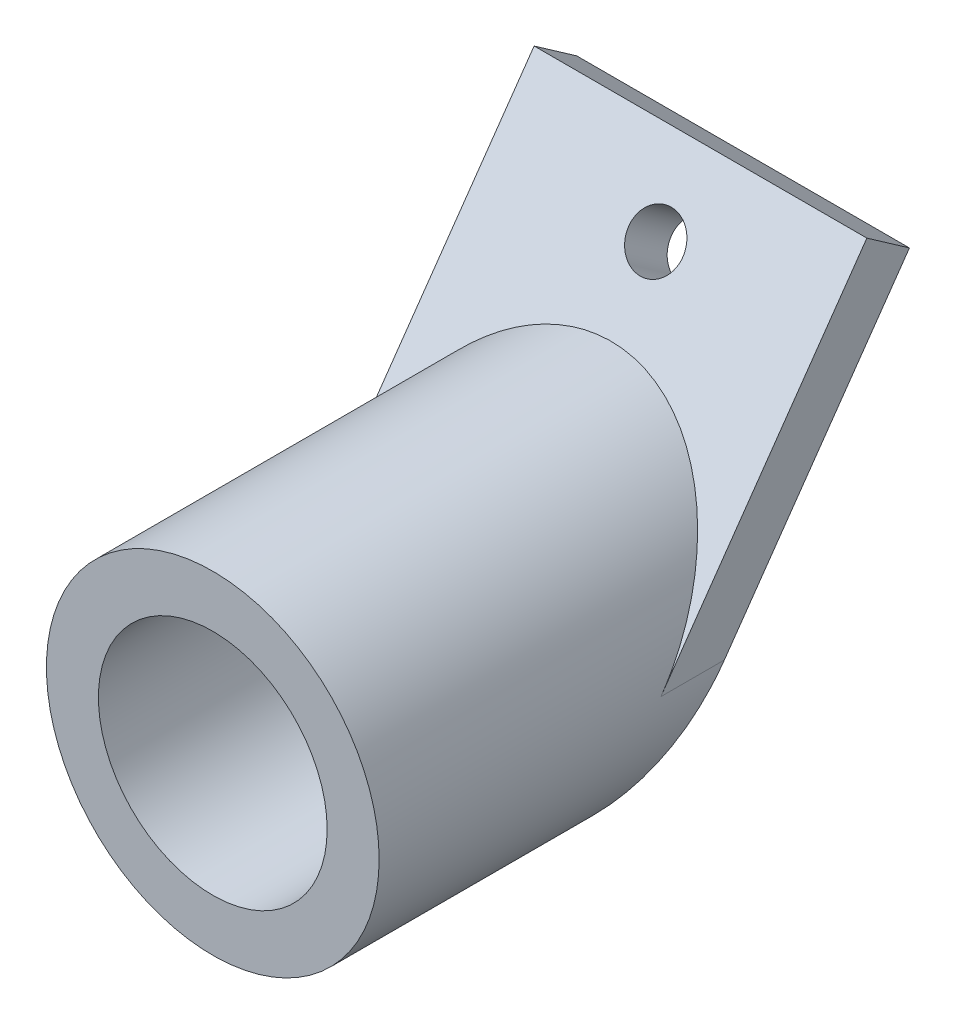
ISO-10303-21;
HEADER;
FILE_DESCRIPTION(('STEP AP214'),'2;1');
FILE_NAME('part.step','',(''),(''),'','','');
FILE_SCHEMA(('AUTOMOTIVE_DESIGN { 1 0 10303 214 1 1 1 1 }'));
ENDSEC;
DATA;
#1=APPLICATION_CONTEXT('core data for automotive mechanical design processes');
#2=APPLICATION_PROTOCOL_DEFINITION('international standard','automotive_design',2000,#1);
#3=PRODUCT_CONTEXT('',#1,'mechanical');
#4=PRODUCT('Part','Part','',(#3));
#5=PRODUCT_RELATED_PRODUCT_CATEGORY('part','',(#4));
#6=PRODUCT_DEFINITION_FORMATION('','',#4);
#7=PRODUCT_DEFINITION_CONTEXT('part definition',#1,'design');
#8=PRODUCT_DEFINITION('design','',#6,#7);
#9=PRODUCT_DEFINITION_SHAPE('','',#8);
#10=(LENGTH_UNIT() NAMED_UNIT(*) SI_UNIT(.MILLI.,.METRE.));
#11=(NAMED_UNIT(*) PLANE_ANGLE_UNIT() SI_UNIT($,.RADIAN.));
#12=(NAMED_UNIT(*) SI_UNIT($,.STERADIAN.) SOLID_ANGLE_UNIT());
#13=UNCERTAINTY_MEASURE_WITH_UNIT(LENGTH_MEASURE(1.E-05),#10,'distance_accuracy_value','');
#14=(GEOMETRIC_REPRESENTATION_CONTEXT(3) GLOBAL_UNCERTAINTY_ASSIGNED_CONTEXT((#13)) GLOBAL_UNIT_ASSIGNED_CONTEXT((#10,
#11,#12)) REPRESENTATION_CONTEXT('',''));
#15=CARTESIAN_POINT('',(0.,0.,0.));
#16=DIRECTION('',(0.,0.,1.));
#17=DIRECTION('',(1.,0.,0.));
#18=AXIS2_PLACEMENT_3D('',#15,#16,#17);
#19=CARTESIAN_POINT('',(16.,16.,-18.3027682789034));
#20=DIRECTION('',(0.,-0.573576436351044,-0.819152044288993));
#21=DIRECTION('',(0.,0.819152044288993,-0.573576436351044));
#22=AXIS2_PLACEMENT_3D('',#19,#20,#21);
#23=PLANE('',#22);
#24=CARTESIAN_POINT('',(0.,22.1436403321675,-22.6045915515363));
#25=DIRECTION('',(0.,0.573576436351044,0.819152044288993));
#26=DIRECTION('',(0.,-0.819152044288993,0.573576436351044));
#27=AXIS2_PLACEMENT_3D('',#24,#25,#26);
#28=CIRCLE('',#27,2.6);
#29=CARTESIAN_POINT('',(0.,20.0138450170161,-21.1132928170235));
#30=VERTEX_POINT('',#29);
#31=EDGE_CURVE('E230',#30,#30,#28,.T.);
#32=ORIENTED_EDGE('',*,*,#31,.F.);
#33=EDGE_LOOP('',(#32));
#34=FACE_BOUND('',#33,.T.);
#35=CARTESIAN_POINT('',(0.,0.,-7.09944766754814));
#36=DIRECTION('',(0.,-0.573576436351044,-0.819152044288993));
#37=DIRECTION('',(0.,-0.819152044288993,0.573576436351044));
#38=AXIS2_PLACEMENT_3D('',#35,#36,#37);
#39=ELLIPSE('',#38,19.5323934201833,16.);
#40=CARTESIAN_POINT('',(16.,0.,-7.09944766754815));
#41=VERTEX_POINT('',#40);
#42=CARTESIAN_POINT('',(-16.,0.,-7.09944766754815));
#43=VERTEX_POINT('',#42);
#44=EDGE_CURVE('E81',#41,#43,#39,.F.);
#45=ORIENTED_EDGE('',*,*,#44,.F.);
#46=DIRECTION('',(0.,-0.819152044288994,0.573576436351043));
#47=VECTOR('',#46,1.);
#48=CARTESIAN_POINT('',(16.,16.,-18.3027682789034));
#49=LINE('',#48,#47);
#50=CARTESIAN_POINT('',(16.,28.2872806643349,-26.9064148241691));
#51=VERTEX_POINT('',#50);
#52=EDGE_CURVE('E103',#51,#41,#49,.T.);
#53=ORIENTED_EDGE('',*,*,#52,.F.);
#54=DIRECTION('',(-1.,0.,0.));
#55=VECTOR('',#54,1.);
#56=CARTESIAN_POINT('',(16.,28.2872806643349,-26.9064148241691));
#57=LINE('',#56,#55);
#58=CARTESIAN_POINT('',(-16.,28.2872806643349,-26.9064148241691));
#59=VERTEX_POINT('',#58);
#60=EDGE_CURVE('E105',#51,#59,#57,.T.);
#61=ORIENTED_EDGE('',*,*,#60,.T.);
#62=DIRECTION('',(0.,-0.819152044288994,0.573576436351043));
#63=VECTOR('',#62,1.);
#64=CARTESIAN_POINT('',(-16.,16.,-18.3027682789034));
#65=LINE('',#64,#63);
#66=EDGE_CURVE('E96',#59,#43,#65,.T.);
#67=ORIENTED_EDGE('',*,*,#66,.T.);
#68=EDGE_LOOP('',(#45,#53,#61,#67));
#69=FACE_BOUND('',#68,.T.);
#70=ADVANCED_FACE('F35',(#34,#69),#23,.F.);
#71=CARTESIAN_POINT('',(0.,0.,20.));
#72=DIRECTION('',(0.,0.,1.));
#73=DIRECTION('',(1.,0.,0.));
#74=AXIS2_PLACEMENT_3D('',#71,#72,#73);
#75=PLANE('',#74);
#76=CARTESIAN_POINT('',(0.,0.,20.));
#77=DIRECTION('',(0.,0.,1.));
#78=DIRECTION('',(1.,0.,0.));
#79=AXIS2_PLACEMENT_3D('',#76,#77,#78);
#80=CIRCLE('',#79,16.);
#81=CARTESIAN_POINT('',(16.,0.,20.));
#82=VERTEX_POINT('',#81);
#83=EDGE_CURVE('E44',#82,#82,#80,.T.);
#84=ORIENTED_EDGE('',*,*,#83,.T.);
#85=EDGE_LOOP('',(#84));
#86=FACE_BOUND('',#85,.T.);
#87=CARTESIAN_POINT('',(0.,0.,20.));
#88=DIRECTION('',(0.,0.,1.));
#89=DIRECTION('',(1.,0.,0.));
#90=AXIS2_PLACEMENT_3D('',#87,#88,#89);
#91=CIRCLE('',#90,11.);
#92=CARTESIAN_POINT('',(11.,0.,20.));
#93=VERTEX_POINT('',#92);
#94=EDGE_CURVE('E110',#93,#93,#91,.T.);
#95=ORIENTED_EDGE('',*,*,#94,.F.);
#96=EDGE_LOOP('',(#95));
#97=FACE_BOUND('',#96,.T.);
#98=ADVANCED_FACE('F118',(#86,#97),#75,.T.);
#99=CARTESIAN_POINT('',(0.,0.,20.));
#100=DIRECTION('',(0.,0.,-1.));
#101=DIRECTION('',(-1.,0.,0.));
#102=AXIS2_PLACEMENT_3D('',#99,#100,#101);
#103=CYLINDRICAL_SURFACE('',#102,16.);
#104=DIRECTION('',(0.,0.,1.));
#105=VECTOR('',#104,1.);
#106=CARTESIAN_POINT('',(16.,0.,-31.002175045614));
#107=LINE('',#106,#105);
#108=CARTESIAN_POINT('',(16.,0.,-13.2033206113553));
#109=VERTEX_POINT('',#108);
#110=EDGE_CURVE('E89',#109,#41,#107,.T.);
#111=ORIENTED_EDGE('',*,*,#110,.T.);
#112=ORIENTED_EDGE('',*,*,#44,.T.);
#113=DIRECTION('',(0.,0.,-1.));
#114=VECTOR('',#113,1.);
#115=CARTESIAN_POINT('',(-16.,0.,0.));
#116=LINE('',#115,#114);
#117=CARTESIAN_POINT('',(-16.,0.,-13.2033206113553));
#118=VERTEX_POINT('',#117);
#119=EDGE_CURVE('E11',#43,#118,#116,.T.);
#120=ORIENTED_EDGE('',*,*,#119,.T.);
#121=CARTESIAN_POINT('',(0.,0.,-13.2033206113553));
#122=DIRECTION('',(0.,0.573576436351044,0.819152044288994));
#123=DIRECTION('',(0.,-0.819152044288994,0.573576436351044));
#124=AXIS2_PLACEMENT_3D('',#121,#122,#123);
#125=ELLIPSE('',#124,19.5323934201833,16.);
#126=EDGE_CURVE('E79',#109,#118,#125,.F.);
#127=ORIENTED_EDGE('',*,*,#126,.F.);
#128=EDGE_LOOP('',(#111,#112,#120,#127));
#129=FACE_BOUND('',#128,.T.);
#130=ORIENTED_EDGE('',*,*,#83,.F.);
#131=EDGE_LOOP('',(#130));
#132=FACE_BOUND('',#131,.T.);
#133=ADVANCED_FACE('F37',(#129,#132),#103,.T.);
#134=CARTESIAN_POINT('',(0.,0.,20.));
#135=DIRECTION('',(0.,0.,-1.));
#136=DIRECTION('',(-1.,0.,0.));
#137=AXIS2_PLACEMENT_3D('',#134,#135,#136);
#138=CYLINDRICAL_SURFACE('',#137,11.);
#139=ORIENTED_EDGE('',*,*,#94,.T.);
#140=EDGE_LOOP('',(#139));
#141=FACE_BOUND('',#140,.T.);
#142=CARTESIAN_POINT('',(0.,0.,0.));
#143=DIRECTION('',(0.,0.,1.));
#144=DIRECTION('',(1.,0.,0.));
#145=AXIS2_PLACEMENT_3D('',#142,#143,#144);
#146=CIRCLE('',#145,11.);
#147=CARTESIAN_POINT('',(11.,0.,0.));
#148=VERTEX_POINT('',#147);
#149=EDGE_CURVE('E109',#148,#148,#146,.T.);
#150=ORIENTED_EDGE('',*,*,#149,.F.);
#151=EDGE_LOOP('',(#150));
#152=FACE_BOUND('',#151,.T.);
#153=ADVANCED_FACE('F121',(#141,#152),#138,.F.);
#154=CARTESIAN_POINT('',(0.,0.,0.));
#155=DIRECTION('',(0.,0.,-1.));
#156=DIRECTION('',(-1.,0.,0.));
#157=AXIS2_PLACEMENT_3D('',#154,#155,#156);
#158=PLANE('',#157);
#159=ORIENTED_EDGE('',*,*,#149,.T.);
#160=EDGE_LOOP('',(#159));
#161=FACE_BOUND('',#160,.T.);
#162=ADVANCED_FACE('F126',(#161),#158,.F.);
#163=CARTESIAN_POINT('',(16.,25.4193984825797,-31.002175045614));
#164=DIRECTION('',(0.,0.573576436351044,0.819152044288994));
#165=DIRECTION('',(0.,-0.819152044288994,0.573576436351044));
#166=AXIS2_PLACEMENT_3D('',#163,#164,#165);
#167=PLANE('',#166);
#168=CARTESIAN_POINT('',(0.,19.2757581504123,-26.7003517729811));
#169=DIRECTION('',(0.,0.573576436351044,0.819152044288994));
#170=DIRECTION('',(0.,-0.819152044288994,0.573576436351044));
#171=AXIS2_PLACEMENT_3D('',#168,#169,#170);
#172=CIRCLE('',#171,2.6);
#173=CARTESIAN_POINT('',(0.,17.1459628352609,-25.2090530384684));
#174=VERTEX_POINT('',#173);
#175=EDGE_CURVE('E39',#174,#174,#172,.T.);
#176=ORIENTED_EDGE('',*,*,#175,.T.);
#177=EDGE_LOOP('',(#176));
#178=FACE_BOUND('',#177,.T.);
#179=DIRECTION('',(0.,0.819152044288994,-0.573576436351044));
#180=VECTOR('',#179,1.);
#181=CARTESIAN_POINT('',(16.,25.4193984825797,-31.002175045614));
#182=LINE('',#181,#180);
#183=CARTESIAN_POINT('',(16.,25.4193984825797,-31.002175045614));
#184=VERTEX_POINT('',#183);
#185=EDGE_CURVE('E88',#109,#184,#182,.T.);
#186=ORIENTED_EDGE('',*,*,#185,.F.);
#187=ORIENTED_EDGE('',*,*,#126,.T.);
#188=DIRECTION('',(0.,0.819152044288994,-0.573576436351044));
#189=VECTOR('',#188,1.);
#190=CARTESIAN_POINT('',(-16.,25.4193984825797,-31.002175045614));
#191=LINE('',#190,#189);
#192=CARTESIAN_POINT('',(-16.,25.4193984825797,-31.002175045614));
#193=VERTEX_POINT('',#192);
#194=EDGE_CURVE('E86',#118,#193,#191,.T.);
#195=ORIENTED_EDGE('',*,*,#194,.T.);
#196=DIRECTION('',(-1.,0.,0.));
#197=VECTOR('',#196,1.);
#198=CARTESIAN_POINT('',(16.,25.4193984825797,-31.002175045614));
#199=LINE('',#198,#197);
#200=EDGE_CURVE('E107',#184,#193,#199,.T.);
#201=ORIENTED_EDGE('',*,*,#200,.F.);
#202=EDGE_LOOP('',(#186,#187,#195,#201));
#203=FACE_BOUND('',#202,.T.);
#204=ADVANCED_FACE('F84',(#178,#203),#167,.F.);
#205=CARTESIAN_POINT('',(16.,25.4193984825797,-31.002175045614));
#206=DIRECTION('',(0.,-0.819152044288994,0.573576436351042));
#207=DIRECTION('',(0.,-0.573576436351042,-0.819152044288994));
#208=AXIS2_PLACEMENT_3D('',#205,#206,#207);
#209=PLANE('',#208);
#210=ORIENTED_EDGE('',*,*,#200,.T.);
#211=DIRECTION('',(0.,0.573576436351042,0.819152044288994));
#212=VECTOR('',#211,1.);
#213=CARTESIAN_POINT('',(-16.,25.4193984825797,-31.002175045614));
#214=LINE('',#213,#212);
#215=EDGE_CURVE('E94',#193,#59,#214,.T.);
#216=ORIENTED_EDGE('',*,*,#215,.T.);
#217=ORIENTED_EDGE('',*,*,#60,.F.);
#218=DIRECTION('',(0.,0.573576436351042,0.819152044288994));
#219=VECTOR('',#218,1.);
#220=CARTESIAN_POINT('',(16.,25.4193984825797,-31.002175045614));
#221=LINE('',#220,#219);
#222=EDGE_CURVE('E57',#184,#51,#221,.T.);
#223=ORIENTED_EDGE('',*,*,#222,.F.);
#224=EDGE_LOOP('',(#210,#216,#217,#223));
#225=FACE_BOUND('',#224,.T.);
#226=ADVANCED_FACE('F140',(#225),#209,.F.);
#227=CARTESIAN_POINT('',(16.,0.,0.));
#228=DIRECTION('',(-1.,0.,0.));
#229=DIRECTION('',(0.,0.,1.));
#230=AXIS2_PLACEMENT_3D('',#227,#228,#229);
#231=PLANE('',#230);
#232=ORIENTED_EDGE('',*,*,#52,.T.);
#233=ORIENTED_EDGE('',*,*,#110,.F.);
#234=ORIENTED_EDGE('',*,*,#185,.T.);
#235=ORIENTED_EDGE('',*,*,#222,.T.);
#236=EDGE_LOOP('',(#232,#233,#234,#235));
#237=FACE_BOUND('',#236,.T.);
#238=ADVANCED_FACE('F138',(#237),#231,.F.);
#239=CARTESIAN_POINT('',(-16.,0.,0.));
#240=DIRECTION('',(-1.,0.,0.));
#241=DIRECTION('',(0.,0.,1.));
#242=AXIS2_PLACEMENT_3D('',#239,#240,#241);
#243=PLANE('',#242);
#244=ORIENTED_EDGE('',*,*,#119,.F.);
#245=ORIENTED_EDGE('',*,*,#66,.F.);
#246=ORIENTED_EDGE('',*,*,#215,.F.);
#247=ORIENTED_EDGE('',*,*,#194,.F.);
#248=EDGE_LOOP('',(#244,#245,#246,#247));
#249=FACE_BOUND('',#248,.T.);
#250=ADVANCED_FACE('F92',(#249),#243,.T.);
#251=CARTESIAN_POINT('',(0.,5.64919321185999,-46.1611033287167));
#252=DIRECTION('',(0.,0.573576436351044,0.819152044288993));
#253=DIRECTION('',(0.,-0.819152044288993,0.573576436351044));
#254=AXIS2_PLACEMENT_3D('',#251,#252,#253);
#255=CYLINDRICAL_SURFACE('',#254,2.6);
#256=ORIENTED_EDGE('',*,*,#31,.T.);
#257=EDGE_LOOP('',(#256));
#258=FACE_BOUND('',#257,.T.);
#259=ORIENTED_EDGE('',*,*,#175,.F.);
#260=EDGE_LOOP('',(#259));
#261=FACE_BOUND('',#260,.T.);
#262=ADVANCED_FACE('F175',(#258,#261),#255,.F.);
#263=CLOSED_SHELL('',(#70,#98,#133,#153,#162,#204,#226,#238,#250,#262));
#264=MANIFOLD_SOLID_BREP('B2',#263);
#265=ADVANCED_BREP_SHAPE_REPRESENTATION('',(#18,#264),#14);
#266=SHAPE_DEFINITION_REPRESENTATION(#9,#265);
ENDSEC;
END-ISO-10303-21;
